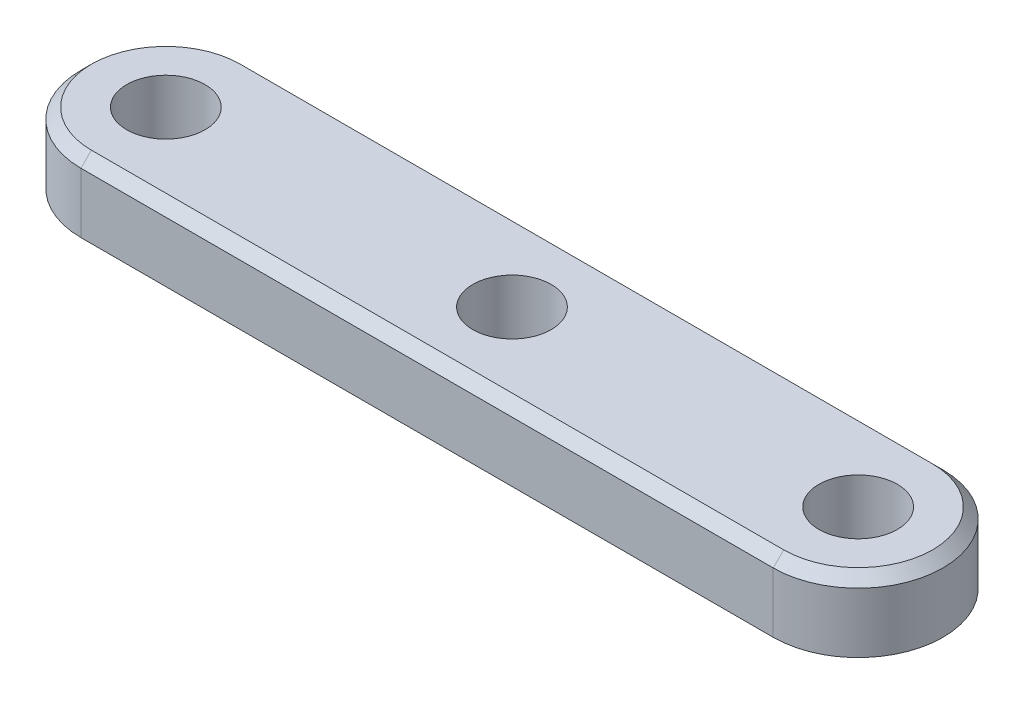
ISO-10303-21;
HEADER;
FILE_DESCRIPTION(('STEP AP214'),'2;1');
FILE_NAME('part.step','',(''),(''),'','','');
FILE_SCHEMA(('AUTOMOTIVE_DESIGN { 1 0 10303 214 1 1 1 1 }'));
ENDSEC;
DATA;
#1=APPLICATION_CONTEXT('core data for automotive mechanical design processes');
#2=APPLICATION_PROTOCOL_DEFINITION('international standard','automotive_design',2000,#1);
#3=PRODUCT_CONTEXT('',#1,'mechanical');
#4=PRODUCT('Part','Part','',(#3));
#5=PRODUCT_RELATED_PRODUCT_CATEGORY('part','',(#4));
#6=PRODUCT_DEFINITION_FORMATION('','',#4);
#7=PRODUCT_DEFINITION_CONTEXT('part definition',#1,'design');
#8=PRODUCT_DEFINITION('design','',#6,#7);
#9=PRODUCT_DEFINITION_SHAPE('','',#8);
#10=(LENGTH_UNIT() NAMED_UNIT(*) SI_UNIT(.MILLI.,.METRE.));
#11=(NAMED_UNIT(*) PLANE_ANGLE_UNIT() SI_UNIT($,.RADIAN.));
#12=(NAMED_UNIT(*) SI_UNIT($,.STERADIAN.) SOLID_ANGLE_UNIT());
#13=UNCERTAINTY_MEASURE_WITH_UNIT(LENGTH_MEASURE(1.E-05),#10,'distance_accuracy_value','');
#14=(GEOMETRIC_REPRESENTATION_CONTEXT(3) GLOBAL_UNCERTAINTY_ASSIGNED_CONTEXT((#13)) GLOBAL_UNIT_ASSIGNED_CONTEXT((#10,
#11,#12)) REPRESENTATION_CONTEXT('',''));
#15=CARTESIAN_POINT('',(0.,0.,0.));
#16=DIRECTION('',(0.,0.,1.));
#17=DIRECTION('',(1.,0.,0.));
#18=AXIS2_PLACEMENT_3D('',#15,#16,#17);
#19=CARTESIAN_POINT('',(-13.25,1.35,0.));
#20=DIRECTION('',(0.,1.,0.));
#21=DIRECTION('',(0.,0.,1.));
#22=AXIS2_PLACEMENT_3D('',#19,#20,#21);
#23=PLANE('',#22);
#24=DIRECTION('',(1.,0.,0.));
#25=VECTOR('',#24,1.);
#26=CARTESIAN_POINT('',(13.25,1.35,2.85));
#27=LINE('',#26,#25);
#28=CARTESIAN_POINT('',(-13.25,1.35,2.85));
#29=VERTEX_POINT('',#28);
#30=CARTESIAN_POINT('',(13.25,1.35,2.85));
#31=VERTEX_POINT('',#30);
#32=EDGE_CURVE('E105',#29,#31,#27,.T.);
#33=ORIENTED_EDGE('',*,*,#32,.T.);
#34=CARTESIAN_POINT('',(13.25,1.35,0.));
#35=DIRECTION('',(0.,1.,0.));
#36=DIRECTION('',(0.,0.,1.));
#37=AXIS2_PLACEMENT_3D('',#34,#35,#36);
#38=CIRCLE('',#37,2.85);
#39=CARTESIAN_POINT('',(13.25,1.35,-2.85));
#40=VERTEX_POINT('',#39);
#41=EDGE_CURVE('E150',#31,#40,#38,.T.);
#42=ORIENTED_EDGE('',*,*,#41,.T.);
#43=DIRECTION('',(-1.,0.,0.));
#44=VECTOR('',#43,1.);
#45=CARTESIAN_POINT('',(-13.25,1.35,-2.85));
#46=LINE('',#45,#44);
#47=CARTESIAN_POINT('',(-13.25,1.35,-2.85));
#48=VERTEX_POINT('',#47);
#49=EDGE_CURVE('E147',#40,#48,#46,.T.);
#50=ORIENTED_EDGE('',*,*,#49,.T.);
#51=CARTESIAN_POINT('',(-13.25,1.35,0.));
#52=DIRECTION('',(0.,1.,0.));
#53=DIRECTION('',(0.,0.,1.));
#54=AXIS2_PLACEMENT_3D('',#51,#52,#53);
#55=CIRCLE('',#54,2.85);
#56=EDGE_CURVE('E144',#48,#29,#55,.T.);
#57=ORIENTED_EDGE('',*,*,#56,.T.);
#58=EDGE_LOOP('',(#33,#42,#50,#57));
#59=FACE_BOUND('',#58,.T.);
#60=CARTESIAN_POINT('',(13.25,1.35,0.));
#61=DIRECTION('',(0.,1.,0.));
#62=DIRECTION('',(0.,0.,-1.));
#63=AXIS2_PLACEMENT_3D('',#60,#61,#62);
#64=CIRCLE('',#63,1.5);
#65=CARTESIAN_POINT('',(13.25,1.35,-1.5));
#66=VERTEX_POINT('',#65);
#67=EDGE_CURVE('E192',#66,#66,#64,.T.);
#68=ORIENTED_EDGE('',*,*,#67,.F.);
#69=EDGE_LOOP('',(#68));
#70=FACE_BOUND('',#69,.T.);
#71=CARTESIAN_POINT('',(-13.25,1.35,0.));
#72=DIRECTION('',(0.,1.,0.));
#73=DIRECTION('',(0.,0.,1.));
#74=AXIS2_PLACEMENT_3D('',#71,#72,#73);
#75=CIRCLE('',#74,1.5);
#76=CARTESIAN_POINT('',(-13.25,1.35,1.50000000000001));
#77=VERTEX_POINT('',#76);
#78=EDGE_CURVE('E122',#77,#77,#75,.T.);
#79=ORIENTED_EDGE('',*,*,#78,.F.);
#80=EDGE_LOOP('',(#79));
#81=FACE_BOUND('',#80,.T.);
#82=CARTESIAN_POINT('',(0.,1.35,0.));
#83=DIRECTION('',(0.,1.,0.));
#84=DIRECTION('',(0.,0.,1.));
#85=AXIS2_PLACEMENT_3D('',#82,#83,#84);
#86=CIRCLE('',#85,1.5);
#87=CARTESIAN_POINT('',(0.,1.35,1.5));
#88=VERTEX_POINT('',#87);
#89=EDGE_CURVE('E183',#88,#88,#86,.T.);
#90=ORIENTED_EDGE('',*,*,#89,.F.);
#91=EDGE_LOOP('',(#90));
#92=FACE_BOUND('',#91,.T.);
#93=ADVANCED_FACE('F45',(#59,#70,#81,#92),#23,.T.);
#94=CARTESIAN_POINT('',(-13.25,-1.35,0.));
#95=DIRECTION('',(0.,1.,0.));
#96=DIRECTION('',(0.,0.,1.));
#97=AXIS2_PLACEMENT_3D('',#94,#95,#96);
#98=PLANE('',#97);
#99=CARTESIAN_POINT('',(-13.25,-1.35,0.));
#100=DIRECTION('',(0.,1.,0.));
#101=DIRECTION('',(0.,0.,1.));
#102=AXIS2_PLACEMENT_3D('',#99,#100,#101);
#103=CIRCLE('',#102,3.25);
#104=CARTESIAN_POINT('',(-13.25,-1.35,-3.25));
#105=VERTEX_POINT('',#104);
#106=CARTESIAN_POINT('',(-13.25,-1.35,3.25));
#107=VERTEX_POINT('',#106);
#108=EDGE_CURVE('E113',#105,#107,#103,.T.);
#109=ORIENTED_EDGE('',*,*,#108,.F.);
#110=DIRECTION('',(-1.,0.,0.));
#111=VECTOR('',#110,1.);
#112=CARTESIAN_POINT('',(-13.25,-1.35,-3.25));
#113=LINE('',#112,#111);
#114=CARTESIAN_POINT('',(13.25,-1.35,-3.25000000000001));
#115=VERTEX_POINT('',#114);
#116=EDGE_CURVE('E132',#115,#105,#113,.T.);
#117=ORIENTED_EDGE('',*,*,#116,.F.);
#118=CARTESIAN_POINT('',(13.25,-1.35,0.));
#119=DIRECTION('',(0.,1.,0.));
#120=DIRECTION('',(0.,0.,1.));
#121=AXIS2_PLACEMENT_3D('',#118,#119,#120);
#122=CIRCLE('',#121,3.25);
#123=CARTESIAN_POINT('',(13.25,-1.35,3.25));
#124=VERTEX_POINT('',#123);
#125=EDGE_CURVE('E115',#124,#115,#122,.T.);
#126=ORIENTED_EDGE('',*,*,#125,.F.);
#127=DIRECTION('',(1.,0.,0.));
#128=VECTOR('',#127,1.);
#129=CARTESIAN_POINT('',(-13.25,-1.35,3.25));
#130=LINE('',#129,#128);
#131=EDGE_CURVE('E101',#107,#124,#130,.T.);
#132=ORIENTED_EDGE('',*,*,#131,.F.);
#133=EDGE_LOOP('',(#109,#117,#126,#132));
#134=FACE_BOUND('',#133,.T.);
#135=CARTESIAN_POINT('',(-13.25,-1.35,0.));
#136=DIRECTION('',(0.,1.,0.));
#137=DIRECTION('',(0.,0.,1.));
#138=AXIS2_PLACEMENT_3D('',#135,#136,#137);
#139=CIRCLE('',#138,1.5);
#140=CARTESIAN_POINT('',(-13.25,-1.35,1.50000000000001));
#141=VERTEX_POINT('',#140);
#142=EDGE_CURVE('E126',#141,#141,#139,.T.);
#143=ORIENTED_EDGE('',*,*,#142,.T.);
#144=EDGE_LOOP('',(#143));
#145=FACE_BOUND('',#144,.T.);
#146=CARTESIAN_POINT('',(13.25,-1.35,0.));
#147=DIRECTION('',(0.,1.,0.));
#148=DIRECTION('',(0.,0.,-1.));
#149=AXIS2_PLACEMENT_3D('',#146,#147,#148);
#150=CIRCLE('',#149,1.5);
#151=CARTESIAN_POINT('',(13.25,-1.35,-1.5));
#152=VERTEX_POINT('',#151);
#153=EDGE_CURVE('E189',#152,#152,#150,.T.);
#154=ORIENTED_EDGE('',*,*,#153,.T.);
#155=EDGE_LOOP('',(#154));
#156=FACE_BOUND('',#155,.T.);
#157=CARTESIAN_POINT('',(0.,-1.35,0.));
#158=DIRECTION('',(0.,1.,0.));
#159=DIRECTION('',(0.,0.,1.));
#160=AXIS2_PLACEMENT_3D('',#157,#158,#159);
#161=CIRCLE('',#160,1.5);
#162=CARTESIAN_POINT('',(0.,-1.35,1.5));
#163=VERTEX_POINT('',#162);
#164=EDGE_CURVE('E177',#163,#163,#161,.T.);
#165=ORIENTED_EDGE('',*,*,#164,.T.);
#166=EDGE_LOOP('',(#165));
#167=FACE_BOUND('',#166,.T.);
#168=ADVANCED_FACE('F110',(#134,#145,#156,#167),#98,.F.);
#169=CARTESIAN_POINT('',(-13.25,1.35,0.));
#170=DIRECTION('',(0.,-1.,0.));
#171=DIRECTION('',(0.,0.,-1.));
#172=AXIS2_PLACEMENT_3D('',#169,#170,#171);
#173=CYLINDRICAL_SURFACE('',#172,3.25);
#174=DIRECTION('',(0.,-1.,0.));
#175=VECTOR('',#174,1.);
#176=CARTESIAN_POINT('',(-13.25,1.35,3.25));
#177=LINE('',#176,#175);
#178=CARTESIAN_POINT('',(-13.25,0.949999999999996,3.25));
#179=VERTEX_POINT('',#178);
#180=EDGE_CURVE('E98',#179,#107,#177,.T.);
#181=ORIENTED_EDGE('',*,*,#180,.F.);
#182=CARTESIAN_POINT('',(-13.25,0.949999999999996,0.));
#183=DIRECTION('',(0.,1.,0.));
#184=DIRECTION('',(0.,0.,1.));
#185=AXIS2_PLACEMENT_3D('',#182,#183,#184);
#186=CIRCLE('',#185,3.25);
#187=CARTESIAN_POINT('',(-13.25,0.949999999999996,-3.25));
#188=VERTEX_POINT('',#187);
#189=EDGE_CURVE('E56',#179,#188,#186,.F.);
#190=ORIENTED_EDGE('',*,*,#189,.T.);
#191=DIRECTION('',(0.,-1.,0.));
#192=VECTOR('',#191,1.);
#193=CARTESIAN_POINT('',(-13.25,1.35,-3.25));
#194=LINE('',#193,#192);
#195=EDGE_CURVE('E119',#188,#105,#194,.T.);
#196=ORIENTED_EDGE('',*,*,#195,.T.);
#197=ORIENTED_EDGE('',*,*,#108,.T.);
#198=EDGE_LOOP('',(#181,#190,#196,#197));
#199=FACE_BOUND('',#198,.T.);
#200=ADVANCED_FACE('F118',(#199),#173,.T.);
#201=CARTESIAN_POINT('',(-13.25,1.35,3.25));
#202=DIRECTION('',(0.,0.,-1.));
#203=DIRECTION('',(-1.,0.,0.));
#204=AXIS2_PLACEMENT_3D('',#201,#202,#203);
#205=PLANE('',#204);
#206=DIRECTION('',(0.,-1.,0.));
#207=VECTOR('',#206,1.);
#208=CARTESIAN_POINT('',(13.25,1.35,3.25));
#209=LINE('',#208,#207);
#210=CARTESIAN_POINT('',(13.25,0.949999999999996,3.25));
#211=VERTEX_POINT('',#210);
#212=EDGE_CURVE('E106',#211,#124,#209,.T.);
#213=ORIENTED_EDGE('',*,*,#212,.F.);
#214=DIRECTION('',(-1.,0.,0.));
#215=VECTOR('',#214,1.);
#216=CARTESIAN_POINT('',(-13.25,0.949999999999996,3.25));
#217=LINE('',#216,#215);
#218=EDGE_CURVE('E11',#211,#179,#217,.T.);
#219=ORIENTED_EDGE('',*,*,#218,.T.);
#220=ORIENTED_EDGE('',*,*,#180,.T.);
#221=ORIENTED_EDGE('',*,*,#131,.T.);
#222=EDGE_LOOP('',(#213,#219,#220,#221));
#223=FACE_BOUND('',#222,.T.);
#224=ADVANCED_FACE('F100',(#223),#205,.F.);
#225=CARTESIAN_POINT('',(13.25,1.35,0.));
#226=DIRECTION('',(0.,-1.,0.));
#227=DIRECTION('',(0.,0.,-1.));
#228=AXIS2_PLACEMENT_3D('',#225,#226,#227);
#229=CYLINDRICAL_SURFACE('',#228,3.25);
#230=DIRECTION('',(0.,-1.,0.));
#231=VECTOR('',#230,1.);
#232=CARTESIAN_POINT('',(13.25,1.35,-3.25000000000001));
#233=LINE('',#232,#231);
#234=CARTESIAN_POINT('',(13.25,0.949999999999996,-3.25000000000001));
#235=VERTEX_POINT('',#234);
#236=EDGE_CURVE('E137',#235,#115,#233,.T.);
#237=ORIENTED_EDGE('',*,*,#236,.F.);
#238=CARTESIAN_POINT('',(13.25,0.949999999999996,0.));
#239=DIRECTION('',(0.,1.,0.));
#240=DIRECTION('',(0.,0.,1.));
#241=AXIS2_PLACEMENT_3D('',#238,#239,#240);
#242=CIRCLE('',#241,3.25);
#243=EDGE_CURVE('E154',#235,#211,#242,.F.);
#244=ORIENTED_EDGE('',*,*,#243,.T.);
#245=ORIENTED_EDGE('',*,*,#212,.T.);
#246=ORIENTED_EDGE('',*,*,#125,.T.);
#247=EDGE_LOOP('',(#237,#244,#245,#246));
#248=FACE_BOUND('',#247,.T.);
#249=ADVANCED_FACE('F227',(#248),#229,.T.);
#250=CARTESIAN_POINT('',(-13.25,1.35,-3.25));
#251=DIRECTION('',(0.,0.,1.));
#252=DIRECTION('',(1.,0.,0.));
#253=AXIS2_PLACEMENT_3D('',#250,#251,#252);
#254=PLANE('',#253);
#255=ORIENTED_EDGE('',*,*,#195,.F.);
#256=DIRECTION('',(1.,0.,0.));
#257=VECTOR('',#256,1.);
#258=CARTESIAN_POINT('',(13.25,0.949999999999996,-3.25000000000001));
#259=LINE('',#258,#257);
#260=EDGE_CURVE('E158',#188,#235,#259,.T.);
#261=ORIENTED_EDGE('',*,*,#260,.T.);
#262=ORIENTED_EDGE('',*,*,#236,.T.);
#263=ORIENTED_EDGE('',*,*,#116,.T.);
#264=EDGE_LOOP('',(#255,#261,#262,#263));
#265=FACE_BOUND('',#264,.T.);
#266=ADVANCED_FACE('F213',(#265),#254,.F.);
#267=CARTESIAN_POINT('',(-13.25,1.35,0.));
#268=DIRECTION('',(0.,-1.,0.));
#269=DIRECTION('',(0.,0.,-1.));
#270=AXIS2_PLACEMENT_3D('',#267,#268,#269);
#271=CYLINDRICAL_SURFACE('',#270,1.5);
#272=ORIENTED_EDGE('',*,*,#78,.T.);
#273=EDGE_LOOP('',(#272));
#274=FACE_BOUND('',#273,.T.);
#275=ORIENTED_EDGE('',*,*,#142,.F.);
#276=EDGE_LOOP('',(#275));
#277=FACE_BOUND('',#276,.T.);
#278=ADVANCED_FACE('F204',(#274,#277),#271,.F.);
#279=CARTESIAN_POINT('',(13.25,1.35,0.));
#280=DIRECTION('',(0.,-1.,0.));
#281=DIRECTION('',(0.,0.,-1.));
#282=AXIS2_PLACEMENT_3D('',#279,#280,#281);
#283=CYLINDRICAL_SURFACE('',#282,1.5);
#284=ORIENTED_EDGE('',*,*,#67,.T.);
#285=EDGE_LOOP('',(#284));
#286=FACE_BOUND('',#285,.T.);
#287=ORIENTED_EDGE('',*,*,#153,.F.);
#288=EDGE_LOOP('',(#287));
#289=FACE_BOUND('',#288,.T.);
#290=ADVANCED_FACE('F201',(#286,#289),#283,.F.);
#291=CARTESIAN_POINT('',(0.,1.35,0.));
#292=DIRECTION('',(0.,-1.,0.));
#293=DIRECTION('',(0.,0.,-1.));
#294=AXIS2_PLACEMENT_3D('',#291,#292,#293);
#295=CYLINDRICAL_SURFACE('',#294,1.5);
#296=ORIENTED_EDGE('',*,*,#89,.T.);
#297=EDGE_LOOP('',(#296));
#298=FACE_BOUND('',#297,.T.);
#299=ORIENTED_EDGE('',*,*,#164,.F.);
#300=EDGE_LOOP('',(#299));
#301=FACE_BOUND('',#300,.T.);
#302=ADVANCED_FACE('F203',(#298,#301),#295,.F.);
#303=CARTESIAN_POINT('',(-13.25,1.35,0.));
#304=DIRECTION('',(0.,-1.,0.));
#305=DIRECTION('',(0.,0.,-1.));
#306=AXIS2_PLACEMENT_3D('',#303,#304,#305);
#307=CONICAL_SURFACE('',#306,2.85,0.785398163397448);
#308=DIRECTION('',(0.,0.707106781186547,0.707106781186547));
#309=VECTOR('',#308,1.);
#310=CARTESIAN_POINT('',(-13.25,0.949999999999996,-3.25));
#311=LINE('',#310,#309);
#312=EDGE_CURVE('E168',#188,#48,#311,.T.);
#313=ORIENTED_EDGE('',*,*,#312,.F.);
#314=ORIENTED_EDGE('',*,*,#189,.F.);
#315=DIRECTION('',(0.,-0.707106781186547,0.707106781186547));
#316=VECTOR('',#315,1.);
#317=CARTESIAN_POINT('',(-13.25,1.35,2.85000000000001));
#318=LINE('',#317,#316);
#319=EDGE_CURVE('E50',#29,#179,#318,.T.);
#320=ORIENTED_EDGE('',*,*,#319,.F.);
#321=ORIENTED_EDGE('',*,*,#56,.F.);
#322=EDGE_LOOP('',(#313,#314,#320,#321));
#323=FACE_BOUND('',#322,.T.);
#324=ADVANCED_FACE('F48',(#323),#307,.T.);
#325=CARTESIAN_POINT('',(-13.25,1.35,2.85));
#326=DIRECTION('',(0.,0.707106781186547,0.707106781186547));
#327=DIRECTION('',(-1.,0.,0.));
#328=AXIS2_PLACEMENT_3D('',#325,#326,#327);
#329=PLANE('',#328);
#330=ORIENTED_EDGE('',*,*,#319,.T.);
#331=ORIENTED_EDGE('',*,*,#218,.F.);
#332=DIRECTION('',(0.,-0.707106781186547,0.707106781186547));
#333=VECTOR('',#332,1.);
#334=CARTESIAN_POINT('',(13.25,1.35,2.85));
#335=LINE('',#334,#333);
#336=EDGE_CURVE('E166',#31,#211,#335,.T.);
#337=ORIENTED_EDGE('',*,*,#336,.F.);
#338=ORIENTED_EDGE('',*,*,#32,.F.);
#339=EDGE_LOOP('',(#330,#331,#337,#338));
#340=FACE_BOUND('',#339,.T.);
#341=ADVANCED_FACE('F249',(#340),#329,.T.);
#342=CARTESIAN_POINT('',(-13.25,1.35,-2.85));
#343=DIRECTION('',(0.,0.707106781186547,-0.707106781186547));
#344=DIRECTION('',(1.,0.,0.));
#345=AXIS2_PLACEMENT_3D('',#342,#343,#344);
#346=PLANE('',#345);
#347=ORIENTED_EDGE('',*,*,#312,.T.);
#348=ORIENTED_EDGE('',*,*,#49,.F.);
#349=DIRECTION('',(0.,0.707106781186547,0.707106781186547));
#350=VECTOR('',#349,1.);
#351=CARTESIAN_POINT('',(13.25,0.949999999999996,-3.25000000000001));
#352=LINE('',#351,#350);
#353=EDGE_CURVE('E163',#235,#40,#352,.T.);
#354=ORIENTED_EDGE('',*,*,#353,.F.);
#355=ORIENTED_EDGE('',*,*,#260,.F.);
#356=EDGE_LOOP('',(#347,#348,#354,#355));
#357=FACE_BOUND('',#356,.T.);
#358=ADVANCED_FACE('F243',(#357),#346,.T.);
#359=CARTESIAN_POINT('',(13.25,1.35,0.));
#360=DIRECTION('',(0.,-1.,0.));
#361=DIRECTION('',(0.,0.,-1.));
#362=AXIS2_PLACEMENT_3D('',#359,#360,#361);
#363=CONICAL_SURFACE('',#362,2.85,0.785398163397448);
#364=ORIENTED_EDGE('',*,*,#336,.T.);
#365=ORIENTED_EDGE('',*,*,#243,.F.);
#366=ORIENTED_EDGE('',*,*,#353,.T.);
#367=ORIENTED_EDGE('',*,*,#41,.F.);
#368=EDGE_LOOP('',(#364,#365,#366,#367));
#369=FACE_BOUND('',#368,.T.);
#370=ADVANCED_FACE('F237',(#369),#363,.T.);
#371=CLOSED_SHELL('',(#93,#168,#200,#224,#249,#266,#278,#290,#302,#324,#341,#358,#370));
#372=MANIFOLD_SOLID_BREP('B2',#371);
#373=ADVANCED_BREP_SHAPE_REPRESENTATION('',(#18,#372),#14);
#374=SHAPE_DEFINITION_REPRESENTATION(#9,#373);
ENDSEC;
END-ISO-10303-21;
